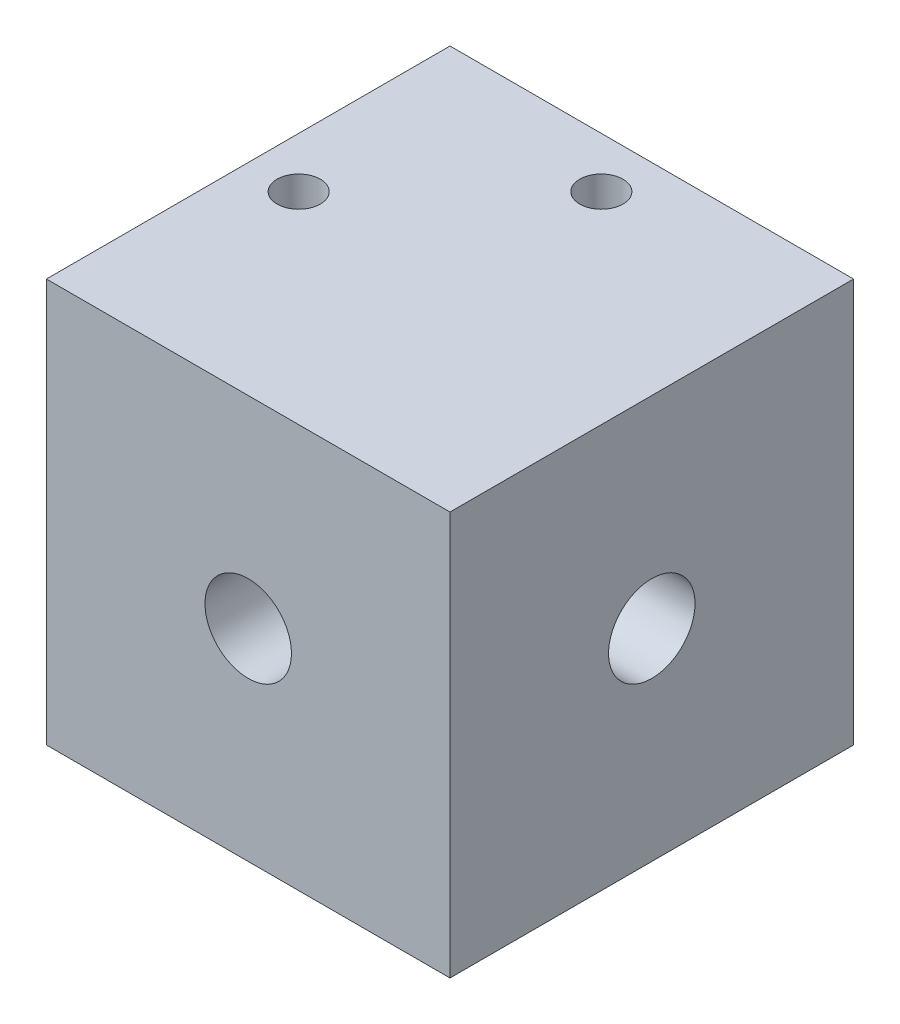
ISO-10303-21;
HEADER;
FILE_DESCRIPTION(('STEP AP214'),'2;1');
FILE_NAME('part.step','',(''),(''),'','','');
FILE_SCHEMA(('AUTOMOTIVE_DESIGN { 1 0 10303 214 1 1 1 1 }'));
ENDSEC;
DATA;
#1=APPLICATION_CONTEXT('core data for automotive mechanical design processes');
#2=APPLICATION_PROTOCOL_DEFINITION('international standard','automotive_design',2000,#1);
#3=PRODUCT_CONTEXT('',#1,'mechanical');
#4=PRODUCT('Part','Part','',(#3));
#5=PRODUCT_RELATED_PRODUCT_CATEGORY('part','',(#4));
#6=PRODUCT_DEFINITION_FORMATION('','',#4);
#7=PRODUCT_DEFINITION_CONTEXT('part definition',#1,'design');
#8=PRODUCT_DEFINITION('design','',#6,#7);
#9=PRODUCT_DEFINITION_SHAPE('','',#8);
#10=(LENGTH_UNIT() NAMED_UNIT(*) SI_UNIT(.MILLI.,.METRE.));
#11=(NAMED_UNIT(*) PLANE_ANGLE_UNIT() SI_UNIT($,.RADIAN.));
#12=(NAMED_UNIT(*) SI_UNIT($,.STERADIAN.) SOLID_ANGLE_UNIT());
#13=UNCERTAINTY_MEASURE_WITH_UNIT(LENGTH_MEASURE(1.E-05),#10,'distance_accuracy_value','');
#14=(GEOMETRIC_REPRESENTATION_CONTEXT(3) GLOBAL_UNCERTAINTY_ASSIGNED_CONTEXT((#13)) GLOBAL_UNIT_ASSIGNED_CONTEXT((#10,
#11,#12)) REPRESENTATION_CONTEXT('',''));
#15=CARTESIAN_POINT('',(0.,0.,0.));
#16=DIRECTION('',(0.,0.,1.));
#17=DIRECTION('',(1.,0.,0.));
#18=AXIS2_PLACEMENT_3D('',#15,#16,#17);
#19=CARTESIAN_POINT('',(0.,0.,28.));
#20=DIRECTION('',(1.,0.,0.));
#21=DIRECTION('',(0.,0.,-1.));
#22=AXIS2_PLACEMENT_3D('',#19,#20,#21);
#23=PLANE('',#22);
#24=CARTESIAN_POINT('',(0.,14.,14.));
#25=DIRECTION('',(-1.,0.,0.));
#26=DIRECTION('',(0.,0.,1.));
#27=AXIS2_PLACEMENT_3D('',#24,#25,#26);
#28=CIRCLE('',#27,3.175);
#29=CARTESIAN_POINT('',(0.,14.,17.175));
#30=VERTEX_POINT('',#29);
#31=EDGE_CURVE('E158',#30,#30,#28,.T.);
#32=ORIENTED_EDGE('',*,*,#31,.F.);
#33=EDGE_LOOP('',(#32));
#34=FACE_BOUND('',#33,.T.);
#35=DIRECTION('',(0.,-1.,0.));
#36=VECTOR('',#35,1.);
#37=CARTESIAN_POINT('',(0.,0.,0.));
#38=LINE('',#37,#36);
#39=CARTESIAN_POINT('',(0.,28.,0.));
#40=VERTEX_POINT('',#39);
#41=CARTESIAN_POINT('',(0.,0.,0.));
#42=VERTEX_POINT('',#41);
#43=EDGE_CURVE('E104',#40,#42,#38,.T.);
#44=ORIENTED_EDGE('',*,*,#43,.T.);
#45=DIRECTION('',(0.,0.,-1.));
#46=VECTOR('',#45,1.);
#47=CARTESIAN_POINT('',(0.,0.,28.));
#48=LINE('',#47,#46);
#49=CARTESIAN_POINT('',(0.,0.,28.));
#50=VERTEX_POINT('',#49);
#51=EDGE_CURVE('E11',#50,#42,#48,.T.);
#52=ORIENTED_EDGE('',*,*,#51,.F.);
#53=DIRECTION('',(0.,-1.,0.));
#54=VECTOR('',#53,1.);
#55=CARTESIAN_POINT('',(0.,0.,28.));
#56=LINE('',#55,#54);
#57=CARTESIAN_POINT('',(0.,28.,28.));
#58=VERTEX_POINT('',#57);
#59=EDGE_CURVE('E91',#58,#50,#56,.T.);
#60=ORIENTED_EDGE('',*,*,#59,.F.);
#61=DIRECTION('',(0.,0.,-1.));
#62=VECTOR('',#61,1.);
#63=CARTESIAN_POINT('',(0.,28.,28.));
#64=LINE('',#63,#62);
#65=EDGE_CURVE('E100',#58,#40,#64,.T.);
#66=ORIENTED_EDGE('',*,*,#65,.T.);
#67=EDGE_LOOP('',(#44,#52,#60,#66));
#68=FACE_BOUND('',#67,.T.);
#69=ADVANCED_FACE('F33',(#34,#68),#23,.F.);
#70=CARTESIAN_POINT('',(0.,0.,28.));
#71=DIRECTION('',(0.,1.,0.));
#72=DIRECTION('',(0.,0.,1.));
#73=AXIS2_PLACEMENT_3D('',#70,#71,#72);
#74=PLANE('',#73);
#75=DIRECTION('',(1.,0.,0.));
#76=VECTOR('',#75,1.);
#77=CARTESIAN_POINT('',(0.,0.,0.));
#78=LINE('',#77,#76);
#79=CARTESIAN_POINT('',(28.,0.,0.));
#80=VERTEX_POINT('',#79);
#81=EDGE_CURVE('E95',#42,#80,#78,.T.);
#82=ORIENTED_EDGE('',*,*,#81,.T.);
#83=DIRECTION('',(0.,0.,-1.));
#84=VECTOR('',#83,1.);
#85=CARTESIAN_POINT('',(28.,0.,28.));
#86=LINE('',#85,#84);
#87=CARTESIAN_POINT('',(28.,0.,28.));
#88=VERTEX_POINT('',#87);
#89=EDGE_CURVE('E47',#88,#80,#86,.T.);
#90=ORIENTED_EDGE('',*,*,#89,.F.);
#91=DIRECTION('',(1.,0.,0.));
#92=VECTOR('',#91,1.);
#93=CARTESIAN_POINT('',(0.,0.,28.));
#94=LINE('',#93,#92);
#95=EDGE_CURVE('E86',#50,#88,#94,.T.);
#96=ORIENTED_EDGE('',*,*,#95,.F.);
#97=ORIENTED_EDGE('',*,*,#51,.T.);
#98=EDGE_LOOP('',(#82,#90,#96,#97));
#99=FACE_BOUND('',#98,.T.);
#100=ADVANCED_FACE('F94',(#99),#74,.F.);
#101=CARTESIAN_POINT('',(28.,0.,28.));
#102=DIRECTION('',(-1.,0.,0.));
#103=DIRECTION('',(0.,0.,1.));
#104=AXIS2_PLACEMENT_3D('',#101,#102,#103);
#105=PLANE('',#104);
#106=CARTESIAN_POINT('',(28.,14.,14.));
#107=DIRECTION('',(1.,0.,0.));
#108=DIRECTION('',(0.,0.,-1.));
#109=AXIS2_PLACEMENT_3D('',#106,#107,#108);
#110=CIRCLE('',#109,3.);
#111=CARTESIAN_POINT('',(28.,14.,11.));
#112=VERTEX_POINT('',#111);
#113=EDGE_CURVE('E188',#112,#112,#110,.T.);
#114=ORIENTED_EDGE('',*,*,#113,.F.);
#115=EDGE_LOOP('',(#114));
#116=FACE_BOUND('',#115,.T.);
#117=DIRECTION('',(0.,1.,0.));
#118=VECTOR('',#117,1.);
#119=CARTESIAN_POINT('',(28.,0.,0.));
#120=LINE('',#119,#118);
#121=CARTESIAN_POINT('',(28.,28.,0.));
#122=VERTEX_POINT('',#121);
#123=EDGE_CURVE('E73',#80,#122,#120,.T.);
#124=ORIENTED_EDGE('',*,*,#123,.T.);
#125=DIRECTION('',(0.,0.,-1.));
#126=VECTOR('',#125,1.);
#127=CARTESIAN_POINT('',(28.,28.,28.));
#128=LINE('',#127,#126);
#129=CARTESIAN_POINT('',(28.,28.,28.));
#130=VERTEX_POINT('',#129);
#131=EDGE_CURVE('E96',#130,#122,#128,.T.);
#132=ORIENTED_EDGE('',*,*,#131,.F.);
#133=DIRECTION('',(0.,1.,0.));
#134=VECTOR('',#133,1.);
#135=CARTESIAN_POINT('',(28.,0.,28.));
#136=LINE('',#135,#134);
#137=EDGE_CURVE('E89',#88,#130,#136,.T.);
#138=ORIENTED_EDGE('',*,*,#137,.F.);
#139=ORIENTED_EDGE('',*,*,#89,.T.);
#140=EDGE_LOOP('',(#124,#132,#138,#139));
#141=FACE_BOUND('',#140,.T.);
#142=ADVANCED_FACE('F98',(#116,#141),#105,.F.);
#143=CARTESIAN_POINT('',(0.,28.,28.));
#144=DIRECTION('',(0.,-1.,0.));
#145=DIRECTION('',(0.,0.,-1.));
#146=AXIS2_PLACEMENT_3D('',#143,#144,#145);
#147=PLANE('',#146);
#148=CARTESIAN_POINT('',(14.,28.,3.5));
#149=DIRECTION('',(0.,1.,0.));
#150=DIRECTION('',(0.,0.,1.));
#151=AXIS2_PLACEMENT_3D('',#148,#149,#150);
#152=CIRCLE('',#151,1.5);
#153=CARTESIAN_POINT('',(14.,28.,5.));
#154=VERTEX_POINT('',#153);
#155=EDGE_CURVE('E119',#154,#154,#152,.T.);
#156=ORIENTED_EDGE('',*,*,#155,.F.);
#157=EDGE_LOOP('',(#156));
#158=FACE_BOUND('',#157,.T.);
#159=CARTESIAN_POINT('',(3.5,28.,14.));
#160=DIRECTION('',(0.,1.,0.));
#161=DIRECTION('',(0.,0.,1.));
#162=AXIS2_PLACEMENT_3D('',#159,#160,#161);
#163=CIRCLE('',#162,1.5);
#164=CARTESIAN_POINT('',(3.5,28.,15.5));
#165=VERTEX_POINT('',#164);
#166=EDGE_CURVE('E308',#165,#165,#163,.T.);
#167=ORIENTED_EDGE('',*,*,#166,.F.);
#168=EDGE_LOOP('',(#167));
#169=FACE_BOUND('',#168,.T.);
#170=DIRECTION('',(-1.,0.,0.));
#171=VECTOR('',#170,1.);
#172=CARTESIAN_POINT('',(0.,28.,0.));
#173=LINE('',#172,#171);
#174=EDGE_CURVE('E79',#122,#40,#173,.T.);
#175=ORIENTED_EDGE('',*,*,#174,.T.);
#176=ORIENTED_EDGE('',*,*,#65,.F.);
#177=DIRECTION('',(-1.,0.,0.));
#178=VECTOR('',#177,1.);
#179=CARTESIAN_POINT('',(0.,28.,28.));
#180=LINE('',#179,#178);
#181=EDGE_CURVE('E56',#130,#58,#180,.T.);
#182=ORIENTED_EDGE('',*,*,#181,.F.);
#183=ORIENTED_EDGE('',*,*,#131,.T.);
#184=EDGE_LOOP('',(#175,#176,#182,#183));
#185=FACE_BOUND('',#184,.T.);
#186=ADVANCED_FACE('F173',(#158,#169,#185),#147,.F.);
#187=CARTESIAN_POINT('',(0.,0.,28.));
#188=DIRECTION('',(0.,0.,-1.));
#189=DIRECTION('',(-1.,0.,0.));
#190=AXIS2_PLACEMENT_3D('',#187,#188,#189);
#191=PLANE('',#190);
#192=CARTESIAN_POINT('',(14.,14.,28.));
#193=DIRECTION('',(0.,0.,1.));
#194=DIRECTION('',(1.,0.,0.));
#195=AXIS2_PLACEMENT_3D('',#192,#193,#194);
#196=CIRCLE('',#195,3.);
#197=CARTESIAN_POINT('',(17.,14.,28.));
#198=VERTEX_POINT('',#197);
#199=EDGE_CURVE('E303',#198,#198,#196,.T.);
#200=ORIENTED_EDGE('',*,*,#199,.F.);
#201=EDGE_LOOP('',(#200));
#202=FACE_BOUND('',#201,.T.);
#203=ORIENTED_EDGE('',*,*,#59,.T.);
#204=ORIENTED_EDGE('',*,*,#95,.T.);
#205=ORIENTED_EDGE('',*,*,#137,.T.);
#206=ORIENTED_EDGE('',*,*,#181,.T.);
#207=EDGE_LOOP('',(#203,#204,#205,#206));
#208=FACE_BOUND('',#207,.T.);
#209=ADVANCED_FACE('F87',(#202,#208),#191,.F.);
#210=CARTESIAN_POINT('',(0.,0.,0.));
#211=DIRECTION('',(0.,0.,-1.));
#212=DIRECTION('',(-1.,0.,0.));
#213=AXIS2_PLACEMENT_3D('',#210,#211,#212);
#214=PLANE('',#213);
#215=CARTESIAN_POINT('',(14.,14.,0.));
#216=DIRECTION('',(0.,0.,-1.));
#217=DIRECTION('',(-1.,0.,0.));
#218=AXIS2_PLACEMENT_3D('',#215,#216,#217);
#219=CIRCLE('',#218,3.175);
#220=CARTESIAN_POINT('',(10.825,14.,0.));
#221=VERTEX_POINT('',#220);
#222=EDGE_CURVE('E195',#221,#221,#219,.T.);
#223=ORIENTED_EDGE('',*,*,#222,.F.);
#224=EDGE_LOOP('',(#223));
#225=FACE_BOUND('',#224,.T.);
#226=ORIENTED_EDGE('',*,*,#43,.F.);
#227=ORIENTED_EDGE('',*,*,#174,.F.);
#228=ORIENTED_EDGE('',*,*,#123,.F.);
#229=ORIENTED_EDGE('',*,*,#81,.F.);
#230=EDGE_LOOP('',(#226,#227,#228,#229));
#231=FACE_BOUND('',#230,.T.);
#232=ADVANCED_FACE('F161',(#225,#231),#214,.T.);
#233=CARTESIAN_POINT('',(10.,14.,14.));
#234=DIRECTION('',(-1.,0.,0.));
#235=DIRECTION('',(0.,0.,1.));
#236=AXIS2_PLACEMENT_3D('',#233,#234,#235);
#237=CYLINDRICAL_SURFACE('',#236,3.175);
#238=CARTESIAN_POINT('',(3.5,16.7983253920872,15.5));
#239=CARTESIAN_POINT('',(3.57881074760103,16.7983309764998,15.4999952354705));
#240=CARTESIAN_POINT('',(3.65773561220573,16.8017042715932,15.4937483244933));
#241=CARTESIAN_POINT('',(3.81321466751469,16.8147264456166,15.4690554061353));
#242=CARTESIAN_POINT('',(3.8897629071629,16.8243899258535,15.4505810136149));
#243=CARTESIAN_POINT('',(4.03795267375673,16.8486300939643,15.4023725335564));
#244=CARTESIAN_POINT('',(4.10961613643182,16.8631827990612,15.3726933219799));
#245=CARTESIAN_POINT('',(4.24692939284759,16.8955250237702,15.3030839906454));
#246=CARTESIAN_POINT('',(4.3125794422789,16.9133144056627,15.2631543070128));
#247=CARTESIAN_POINT('',(4.4413232452584,16.9517222772286,15.1707430871524));
#248=CARTESIAN_POINT('',(4.50387788849068,16.9724525418849,15.117556586508));
#249=CARTESIAN_POINT('',(4.61959143684936,17.0134995104479,15.0016125967222));
#250=CARTESIAN_POINT('',(4.67274606260041,17.0338160222877,14.9388507724919));
#251=CARTESIAN_POINT('',(4.77118937954777,17.0731728871697,14.8010349007045));
#252=CARTESIAN_POINT('',(4.81583450125175,17.0920686666025,14.7254760172334));
#253=CARTESIAN_POINT('',(4.89153752206177,17.1250338159502,14.5668616866192));
#254=CARTESIAN_POINT('',(4.92260309774527,17.1391059117413,14.4838105070236));
#255=CARTESIAN_POINT('',(4.96819431985617,17.1600375054618,14.3182638331671));
#256=CARTESIAN_POINT('',(4.9836598006004,17.1673046412502,14.2360798375968));
#257=CARTESIAN_POINT('',(5.00068669846295,17.1753150092679,14.0699854874354));
#258=CARTESIAN_POINT('',(5.00225551712035,17.1760617143584,13.9860760756969));
#259=CARTESIAN_POINT('',(4.99185310738047,17.1711569999128,13.8258959530441));
#260=CARTESIAN_POINT('',(4.9809263684281,17.1659991039016,13.7495390736925));
#261=CARTESIAN_POINT('',(4.94768451199486,17.1505871330944,13.5998932424077));
#262=CARTESIAN_POINT('',(4.92536854800002,17.1403326794939,13.5266045189561));
#263=CARTESIAN_POINT('',(4.86978180811971,17.1154938397116,13.3838378400075));
#264=CARTESIAN_POINT('',(4.83635400002596,17.1008476991608,13.3144322145481));
#265=CARTESIAN_POINT('',(4.75968096352203,17.068584813897,13.1820377817159));
#266=CARTESIAN_POINT('',(4.71643213988174,17.0509669819304,13.11905133651));
#267=CARTESIAN_POINT('',(4.61701776567009,17.0126518994224,12.9954633310695));
#268=CARTESIAN_POINT('',(4.56005736803148,16.9918200943109,12.9355421585215));
#269=CARTESIAN_POINT('',(4.43699705964444,16.9504628336178,12.8257587506611));
#270=CARTESIAN_POINT('',(4.37089145595116,16.929937577752,12.7759028289429));
#271=CARTESIAN_POINT('',(4.22717213815108,16.8903971106644,12.6851582576916));
#272=CARTESIAN_POINT('',(4.1491389419963,16.8715157726024,12.6448701363454));
#273=CARTESIAN_POINT('',(3.98628374353103,16.8391483414,12.5782943705373));
#274=CARTESIAN_POINT('',(3.90146821987563,16.8256571716003,12.5519935445559));
#275=CARTESIAN_POINT('',(3.7342537047376,16.8069797461398,12.516129400851));
#276=CARTESIAN_POINT('',(3.65215755806985,16.8012422746467,12.5054500864004));
#277=CARTESIAN_POINT('',(3.48716354553712,16.7971423453247,12.4977867197404));
#278=CARTESIAN_POINT('',(3.40426614677313,16.7987758220601,12.500795118101));
#279=CARTESIAN_POINT('',(3.24815889881929,16.8086528438024,12.5193982652436));
#280=CARTESIAN_POINT('',(3.17476186646032,16.8162714412626,12.5338039110307));
#281=CARTESIAN_POINT('',(3.03153636694861,16.8363794851209,12.5730943784603));
#282=CARTESIAN_POINT('',(2.96170892426149,16.8488703210638,12.5979821897404));
#283=CARTESIAN_POINT('',(2.82396419247503,16.8780031481495,12.6587675405726));
#284=CARTESIAN_POINT('',(2.75628400585994,16.8948101939309,12.6951204110158));
#285=CARTESIAN_POINT('',(2.62761017139926,16.9305050785042,12.7773903258312));
#286=CARTESIAN_POINT('',(2.56661988219401,16.9493939530175,12.8233121410168));
#287=CARTESIAN_POINT('',(2.44604877570716,16.9896253343588,12.9293374977957));
#288=CARTESIAN_POINT('',(2.38736099080934,17.0110091844446,12.9904453775233));
#289=CARTESIAN_POINT('',(2.2808337868781,17.0519781646558,13.1220471641673));
#290=CARTESIAN_POINT('',(2.23299686115371,17.0715628807626,13.192543222404));
#291=CARTESIAN_POINT('',(2.14893659567304,17.1071725849173,13.3426259507084));
#292=CARTESIAN_POINT('',(2.11291755822127,17.1231336156543,13.4223432461177));
#293=CARTESIAN_POINT('',(2.05513406497645,17.1492209359764,13.5876727067004));
#294=CARTESIAN_POINT('',(2.03335845768791,17.1593517893872,13.6732802021271));
#295=CARTESIAN_POINT('',(2.00636110564541,17.1719797104458,13.8401036671258));
#296=CARTESIAN_POINT('',(1.99988986367358,17.1750523384011,13.9210746017159));
#297=CARTESIAN_POINT('',(2.00011288034317,17.1749463652988,14.0829833461657));
#298=CARTESIAN_POINT('',(2.00680346488907,17.1717695087712,14.163921158963));
#299=CARTESIAN_POINT('',(2.03229151976912,17.1598541037809,14.3188418428355));
#300=CARTESIAN_POINT('',(2.05040802508006,17.1514286867549,14.3929631676006));
#301=CARTESIAN_POINT('',(2.09737891452522,17.1301013292898,14.5370264340225));
#302=CARTESIAN_POINT('',(2.12623500759118,17.1171986764347,14.606967708474));
#303=CARTESIAN_POINT('',(2.19526509810714,17.0873851030128,14.7441984436184));
#304=CARTESIAN_POINT('',(2.23589060609179,17.0703197298679,14.8112262861311));
#305=CARTESIAN_POINT('',(2.32671567908028,17.0340547772448,14.9378054129076));
#306=CARTESIAN_POINT('',(2.37691959144519,17.01485423033,14.9973532817963));
#307=CARTESIAN_POINT('',(2.49071553221918,16.9742574938223,15.1128761340612));
#308=CARTESIAN_POINT('',(2.5551036268264,16.9528185885393,15.1680544294268));
#309=CARTESIAN_POINT('',(2.69268785425151,16.9117133370068,15.2670565138128));
#310=CARTESIAN_POINT('',(2.76589040125549,16.8920483000069,15.3108719601901));
#311=CARTESIAN_POINT('',(2.9207675777892,16.8566355494113,15.3863737982034));
#312=CARTESIAN_POINT('',(3.00256064747477,16.84095675907,15.417851302723));
#313=CARTESIAN_POINT('',(3.17118800167078,16.8163562821414,15.4661232120466));
#314=CARTESIAN_POINT('',(3.25800430332792,16.8074119248326,15.4829669096812));
#315=CARTESIAN_POINT('',(3.37130536675201,16.8011642967236,15.4946926867287));
#316=CARTESIAN_POINT('',(3.39698819225242,16.8001026010393,15.4966804894051));
#317=CARTESIAN_POINT('',(3.44844327049182,16.7986822173246,15.4993349590309));
#318=CARTESIAN_POINT('',(3.47421552771091,16.7983235650378,15.5000015588087));
#319=CARTESIAN_POINT('',(3.5,16.7983253920872,15.5));
#320=B_SPLINE_CURVE_WITH_KNOTS('',3,(#238,#239,#240,#241,#242,#243,#244,#245,#246,#247,#248,
#249,#250,#251,#252,#253,#254,#255,#256,#257,#258,#259,#260,#261,#262,#263,#264,#265,#266,#267,
#268,#269,#270,#271,#272,#273,#274,#275,#276,#277,#278,#279,#280,#281,#282,#283,#284,#285,#286,
#287,#288,#289,#290,#291,#292,#293,#294,#295,#296,#297,#298,#299,#300,#301,#302,#303,#304,#305,
#306,#307,#308,#309,#310,#311,#312,#313,#314,#315,#316,#317,#318,#319),.UNSPECIFIED.,.T.,.F.,(4,
2,2,2,2,2,2,2,2,2,2,2,2,2,2,2,2,2,2,2,2,2,2,2,2,2,2,2,2,2,2,2,2,2,2,2,2,2,2,2,4),(0.,
0.236323871838544,0.473198284289302,0.708927337380699,0.944646362603914,1.19762429635865,
1.45071710395354,1.71864285343498,1.98641694681215,2.23687152724756,2.48719270436037,
2.7180281701866,2.94888079555674,3.1831453100556,3.41749572162706,3.67216706074964,
3.92699765369087,4.19506898546716,4.46288723920479,4.71043828617547,4.95785281342715,
5.18239796950746,5.40700721193729,5.64198832122139,5.87708686716682,6.13804637958085,
6.39906579463174,6.66438519401193,6.92949661955738,7.17207877892644,7.41459323161728,
7.64386670961211,7.87317668624822,8.11282240294707,8.35257714778319,8.61378861881715,
8.87519133270404,9.14084608292566,9.40560248746476,9.48291651801969,9.56023447921351),.UNSPECIFIED.);
#321=CARTESIAN_POINT('',(3.5,16.7983253920872,15.5));
#322=VERTEX_POINT('',#321);
#323=EDGE_CURVE('E36',#322,#322,#320,.T.);
#324=ORIENTED_EDGE('',*,*,#323,.T.);
#325=EDGE_LOOP('',(#324));
#326=FACE_BOUND('',#325,.T.);
#327=CARTESIAN_POINT('',(10.,14.,14.));
#328=DIRECTION('',(-1.,0.,0.));
#329=DIRECTION('',(0.,0.,1.));
#330=AXIS2_PLACEMENT_3D('',#327,#328,#329);
#331=CIRCLE('',#330,3.175);
#332=CARTESIAN_POINT('',(10.,14.,17.175));
#333=VERTEX_POINT('',#332);
#334=EDGE_CURVE('E107',#333,#333,#331,.T.);
#335=ORIENTED_EDGE('',*,*,#334,.F.);
#336=EDGE_LOOP('',(#335));
#337=FACE_BOUND('',#336,.T.);
#338=ORIENTED_EDGE('',*,*,#31,.T.);
#339=EDGE_LOOP('',(#338));
#340=FACE_BOUND('',#339,.T.);
#341=ADVANCED_FACE('F163',(#326,#337,#340),#237,.F.);
#342=CARTESIAN_POINT('',(10.,14.,14.));
#343=DIRECTION('',(-1.,0.,0.));
#344=DIRECTION('',(0.,0.,1.));
#345=AXIS2_PLACEMENT_3D('',#342,#343,#344);
#346=PLANE('',#345);
#347=ORIENTED_EDGE('',*,*,#334,.T.);
#348=EDGE_LOOP('',(#347));
#349=FACE_BOUND('',#348,.T.);
#350=ADVANCED_FACE('F171',(#349),#346,.T.);
#351=CARTESIAN_POINT('',(18.,14.,14.));
#352=DIRECTION('',(1.,0.,0.));
#353=DIRECTION('',(0.,0.,-1.));
#354=AXIS2_PLACEMENT_3D('',#351,#352,#353);
#355=CYLINDRICAL_SURFACE('',#354,3.);
#356=CARTESIAN_POINT('',(18.,14.,14.));
#357=DIRECTION('',(1.,0.,0.));
#358=DIRECTION('',(0.,0.,-1.));
#359=AXIS2_PLACEMENT_3D('',#356,#357,#358);
#360=CIRCLE('',#359,3.);
#361=CARTESIAN_POINT('',(18.,14.,11.));
#362=VERTEX_POINT('',#361);
#363=EDGE_CURVE('E190',#362,#362,#360,.T.);
#364=ORIENTED_EDGE('',*,*,#363,.F.);
#365=EDGE_LOOP('',(#364));
#366=FACE_BOUND('',#365,.T.);
#367=ORIENTED_EDGE('',*,*,#113,.T.);
#368=EDGE_LOOP('',(#367));
#369=FACE_BOUND('',#368,.T.);
#370=ADVANCED_FACE('F206',(#366,#369),#355,.F.);
#371=CARTESIAN_POINT('',(18.,14.,14.));
#372=DIRECTION('',(1.,0.,0.));
#373=DIRECTION('',(0.,0.,-1.));
#374=AXIS2_PLACEMENT_3D('',#371,#372,#373);
#375=PLANE('',#374);
#376=ORIENTED_EDGE('',*,*,#363,.T.);
#377=EDGE_LOOP('',(#376));
#378=FACE_BOUND('',#377,.T.);
#379=ADVANCED_FACE('F147',(#378),#375,.T.);
#380=CARTESIAN_POINT('',(14.,14.,10.));
#381=DIRECTION('',(0.,0.,-1.));
#382=DIRECTION('',(-1.,0.,0.));
#383=AXIS2_PLACEMENT_3D('',#380,#381,#382);
#384=CYLINDRICAL_SURFACE('',#383,3.175);
#385=CARTESIAN_POINT('',(14.,17.175,5.));
#386=CARTESIAN_POINT('',(14.0793696056332,17.1749962198529,4.99999552610351));
#387=CARTESIAN_POINT('',(14.1588489662133,17.1719912037081,4.99366335348418));
#388=CARTESIAN_POINT('',(14.3154907966577,17.1602676274242,4.9685996128575));
#389=CARTESIAN_POINT('',(14.3926478760417,17.1515367075325,4.94984122112576));
#390=CARTESIAN_POINT('',(14.5421346140165,17.1292818514019,4.90080463386028));
#391=CARTESIAN_POINT('',(14.614481134827,17.1157758339669,4.87056947468804));
#392=CARTESIAN_POINT('',(14.7529827574799,17.0852355755794,4.79964446831745));
#393=CARTESIAN_POINT('',(14.819138798737,17.0682018712234,4.75895621091421));
#394=CARTESIAN_POINT('',(14.9475319775514,17.0310921500245,4.66568662754686));
#395=CARTESIAN_POINT('',(15.009345315363,17.0108994960739,4.61256891765261));
#396=CARTESIAN_POINT('',(15.1235687280467,16.9701687775105,4.49709401541805));
#397=CARTESIAN_POINT('',(15.1759724512306,16.9496304897401,4.43473063351146));
#398=CARTESIAN_POINT('',(15.2734072110871,16.9089573421116,4.2974843645497));
#399=CARTESIAN_POINT('',(15.317705296114,16.8889425290662,4.22204154314482));
#400=CARTESIAN_POINT('',(15.3927986049707,16.8535019491363,4.06371450605077));
#401=CARTESIAN_POINT('',(15.4236026358555,16.8380731912287,3.98083518657092));
#402=CARTESIAN_POINT('',(15.4689676208797,16.8148498152315,3.81481732997647));
#403=CARTESIAN_POINT('',(15.4843494240768,16.806672451712,3.73195910458647));
#404=CARTESIAN_POINT('',(15.5009699497078,16.7978229064724,3.56446669966953));
#405=CARTESIAN_POINT('',(15.5022201551264,16.7971446311897,3.47983401805993));
#406=CARTESIAN_POINT('',(15.4911487105296,16.8030559326381,3.32062469140227));
#407=CARTESIAN_POINT('',(15.4802236603169,16.808897712241,3.24591684055565));
#408=CARTESIAN_POINT('',(15.447504692431,16.8258965791071,3.09955531913525));
#409=CARTESIAN_POINT('',(15.4257078792116,16.8370550823719,3.02790246774061));
#410=CARTESIAN_POINT('',(15.3714404210704,16.8636871107933,2.88767854274785));
#411=CARTESIAN_POINT('',(15.3387342163375,16.8792546044257,2.8192173067294));
#412=CARTESIAN_POINT('',(15.2637503491799,16.9129448124016,2.68844422930819));
#413=CARTESIAN_POINT('',(15.2214684733696,16.9310686502324,2.62613511227864));
#414=CARTESIAN_POINT('',(15.1230182930409,16.9702796730848,2.50211398210142));
#415=CARTESIAN_POINT('',(15.0658268591397,16.9914718417441,2.44124465826451));
#416=CARTESIAN_POINT('',(14.9419116545217,17.0327696924474,2.32963307898786));
#417=CARTESIAN_POINT('',(14.8751842405231,17.0528749551668,2.27889471198726));
#418=CARTESIAN_POINT('',(14.7309004519425,17.0906581318842,2.18723446950541));
#419=CARTESIAN_POINT('',(14.6530327647494,17.1082173793419,2.1467498749094));
#420=CARTESIAN_POINT('',(14.49054980641,17.1379589656138,2.07976514725872));
#421=CARTESIAN_POINT('',(14.4059393893946,17.1501451319824,2.05325505672055));
#422=CARTESIAN_POINT('',(14.2393253311837,17.1669884938552,2.01695327830055));
#423=CARTESIAN_POINT('',(14.1576180853724,17.1721506963645,2.00603697774867));
#424=CARTESIAN_POINT('',(13.9933799376267,17.176053743089,1.99776549827472));
#425=CARTESIAN_POINT('',(13.9108493799086,17.1747971671513,2.00040487103399));
#426=CARTESIAN_POINT('',(13.7532090952437,17.166312504254,2.01845895022593));
#427=CARTESIAN_POINT('',(13.6779743827367,17.159493038986,2.03299968212115));
#428=CARTESIAN_POINT('',(13.5311400886124,17.1410624985619,2.07312746629385));
#429=CARTESIAN_POINT('',(13.4595409292445,17.1294508682454,2.09871579842439));
#430=CARTESIAN_POINT('',(13.3195173353867,17.1020662900049,2.16097277598054));
#431=CARTESIAN_POINT('',(13.2512555663097,17.0861775760538,2.19795459585581));
#432=CARTESIAN_POINT('',(13.1216665868865,17.0518284264566,2.28160542554883));
#433=CARTESIAN_POINT('',(13.0603424375466,17.0333668635778,2.32827868585652));
#434=CARTESIAN_POINT('',(12.9405552849953,16.9937484761592,2.43484016430619));
#435=CARTESIAN_POINT('',(12.8828417829848,16.972498405013,2.49553803008255));
#436=CARTESIAN_POINT('',(12.7781241783603,16.9310107026401,2.6259200433733));
#437=CARTESIAN_POINT('',(12.7311255615651,16.9107735941505,2.69560876557418));
#438=CARTESIAN_POINT('',(12.6476822639998,16.8729842223829,2.84515860569975));
#439=CARTESIAN_POINT('',(12.6116642516864,16.8555506324579,2.9252902768506));
#440=CARTESIAN_POINT('',(12.5540020334893,16.8267950409338,3.09157573608092));
#441=CARTESIAN_POINT('',(12.5323414502105,16.8154660786089,3.17772253828127));
#442=CARTESIAN_POINT('',(12.5058344464147,16.8014814830717,3.34513659709301));
#443=CARTESIAN_POINT('',(12.4996325114881,16.7981279282329,3.42613047173134));
#444=CARTESIAN_POINT('',(12.5004008875279,16.7985407587054,3.58802567182791));
#445=CARTESIAN_POINT('',(12.5073672166887,16.8023049917478,3.66892701786345));
#446=CARTESIAN_POINT('',(12.5330445254315,16.8158210937383,3.82186185816675));
#447=CARTESIAN_POINT('',(12.5508163710003,16.8250929307701,3.894100315709));
#448=CARTESIAN_POINT('',(12.5965273788888,16.848076581696,4.03452895410737));
#449=CARTESIAN_POINT('',(12.6244696000373,16.8617897312164,4.1027179098565));
#450=CARTESIAN_POINT('',(12.6918383409616,16.8932343336355,4.23811055182919));
#451=CARTESIAN_POINT('',(12.7319059246599,16.9111726221189,4.3049459695603));
#452=CARTESIAN_POINT('',(12.8216193026593,16.9486278169195,4.43136079818433));
#453=CARTESIAN_POINT('',(12.8712696765585,16.9681454754144,4.49093671747963));
#454=CARTESIAN_POINT('',(12.984810546229,17.0089894883919,4.6075560784686));
#455=CARTESIAN_POINT('',(13.0496444590915,17.0302931523651,4.66369381341707));
#456=CARTESIAN_POINT('',(13.1884935537988,17.0703906077135,4.76444175427494));
#457=CARTESIAN_POINT('',(13.2625131498698,17.0891831832939,4.80904638589811));
#458=CARTESIAN_POINT('',(13.4176896766403,17.1221480350956,4.8850463197749));
#459=CARTESIAN_POINT('',(13.4988207047534,17.1363362610532,4.91648733383919));
#460=CARTESIAN_POINT('',(13.6659587975105,17.1584955078923,4.96490242402554));
#461=CARTESIAN_POINT('',(13.7519506429211,17.1664848936211,4.98191924759624));
#462=CARTESIAN_POINT('',(13.8655506725104,17.1722666617444,4.99420643339842));
#463=CARTESIAN_POINT('',(13.8923802491838,17.1732895170822,4.99637655199677));
#464=CARTESIAN_POINT('',(13.946135668054,17.174656835165,4.99927411038089));
#465=CARTESIAN_POINT('',(13.9730615123532,17.175001283003,5.00000151846547));
#466=CARTESIAN_POINT('',(14.,17.175,5.));
#467=B_SPLINE_CURVE_WITH_KNOTS('',3,(#385,#386,#387,#388,#389,#390,#391,#392,#393,#394,#395,
#396,#397,#398,#399,#400,#401,#402,#403,#404,#405,#406,#407,#408,#409,#410,#411,#412,#413,#414,
#415,#416,#417,#418,#419,#420,#421,#422,#423,#424,#425,#426,#427,#428,#429,#430,#431,#432,#433,
#434,#435,#436,#437,#438,#439,#440,#441,#442,#443,#444,#445,#446,#447,#448,#449,#450,#451,#452,
#453,#454,#455,#456,#457,#458,#459,#460,#461,#462,#463,#464,#465,#466),.UNSPECIFIED.,.T.,.F.,(4,
2,2,2,2,2,2,2,2,2,2,2,2,2,2,2,2,2,2,2,2,2,2,2,2,2,2,2,2,2,2,2,2,2,2,2,2,2,2,2,4),(0.,
0.237998863435126,0.476513162034361,0.714141760487186,0.951734239756924,1.202566267352,
1.45356698050229,1.72144991719773,1.98915775546694,2.24170968929962,2.4940563909499,
2.72018464462581,2.94637315667183,3.17780125644152,3.40933138528568,3.66670059385932,
3.92416839616743,4.19124985366182,4.45814074508091,4.70459764976703,4.9509555058397,
5.18069145066332,5.41045401730286,5.64720089890939,5.88405183355053,6.14213867221334,
6.40035735120202,6.66760822573517,6.93455372246491,7.17710763594645,7.41958821796886,
7.64352093670394,7.86752106087491,8.10644389425158,8.34548119240928,8.60934561245707,
8.8733373285024,9.13640455025374,9.39868939422997,9.47946576344204,9.56024390756227),.UNSPECIFIED.);
#468=CARTESIAN_POINT('',(14.,17.175,5.));
#469=VERTEX_POINT('',#468);
#470=EDGE_CURVE('E112',#469,#469,#467,.T.);
#471=ORIENTED_EDGE('',*,*,#470,.T.);
#472=EDGE_LOOP('',(#471));
#473=FACE_BOUND('',#472,.T.);
#474=CARTESIAN_POINT('',(14.,14.,10.));
#475=DIRECTION('',(0.,0.,-1.));
#476=DIRECTION('',(-1.,0.,0.));
#477=AXIS2_PLACEMENT_3D('',#474,#475,#476);
#478=CIRCLE('',#477,3.175);
#479=CARTESIAN_POINT('',(10.825,14.,10.));
#480=VERTEX_POINT('',#479);
#481=EDGE_CURVE('E191',#480,#480,#478,.T.);
#482=ORIENTED_EDGE('',*,*,#481,.F.);
#483=EDGE_LOOP('',(#482));
#484=FACE_BOUND('',#483,.T.);
#485=ORIENTED_EDGE('',*,*,#222,.T.);
#486=EDGE_LOOP('',(#485));
#487=FACE_BOUND('',#486,.T.);
#488=ADVANCED_FACE('F120',(#473,#484,#487),#384,.F.);
#489=CARTESIAN_POINT('',(14.,14.,10.));
#490=DIRECTION('',(0.,0.,-1.));
#491=DIRECTION('',(-1.,0.,0.));
#492=AXIS2_PLACEMENT_3D('',#489,#490,#491);
#493=PLANE('',#492);
#494=ORIENTED_EDGE('',*,*,#481,.T.);
#495=EDGE_LOOP('',(#494));
#496=FACE_BOUND('',#495,.T.);
#497=ADVANCED_FACE('F139',(#496),#493,.T.);
#498=CARTESIAN_POINT('',(14.,14.,18.));
#499=DIRECTION('',(0.,0.,1.));
#500=DIRECTION('',(1.,0.,0.));
#501=AXIS2_PLACEMENT_3D('',#498,#499,#500);
#502=CYLINDRICAL_SURFACE('',#501,3.);
#503=CARTESIAN_POINT('',(14.,14.,18.));
#504=DIRECTION('',(0.,0.,1.));
#505=DIRECTION('',(1.,0.,0.));
#506=AXIS2_PLACEMENT_3D('',#503,#504,#505);
#507=CIRCLE('',#506,3.);
#508=CARTESIAN_POINT('',(17.,14.,18.));
#509=VERTEX_POINT('',#508);
#510=EDGE_CURVE('E301',#509,#509,#507,.T.);
#511=ORIENTED_EDGE('',*,*,#510,.F.);
#512=EDGE_LOOP('',(#511));
#513=FACE_BOUND('',#512,.T.);
#514=ORIENTED_EDGE('',*,*,#199,.T.);
#515=EDGE_LOOP('',(#514));
#516=FACE_BOUND('',#515,.T.);
#517=ADVANCED_FACE('F136',(#513,#516),#502,.F.);
#518=CARTESIAN_POINT('',(14.,14.,18.));
#519=DIRECTION('',(0.,0.,1.));
#520=DIRECTION('',(1.,0.,0.));
#521=AXIS2_PLACEMENT_3D('',#518,#519,#520);
#522=PLANE('',#521);
#523=ORIENTED_EDGE('',*,*,#510,.T.);
#524=EDGE_LOOP('',(#523));
#525=FACE_BOUND('',#524,.T.);
#526=ADVANCED_FACE('F128',(#525),#522,.T.);
#527=CARTESIAN_POINT('',(14.,16.,3.5));
#528=DIRECTION('',(0.,1.,0.));
#529=DIRECTION('',(0.,0.,1.));
#530=AXIS2_PLACEMENT_3D('',#527,#528,#529);
#531=CYLINDRICAL_SURFACE('',#530,1.5);
#532=ORIENTED_EDGE('',*,*,#155,.T.);
#533=EDGE_LOOP('',(#532));
#534=FACE_BOUND('',#533,.T.);
#535=ORIENTED_EDGE('',*,*,#470,.F.);
#536=EDGE_LOOP('',(#535));
#537=FACE_BOUND('',#536,.T.);
#538=ADVANCED_FACE('F124',(#534,#537),#531,.F.);
#539=CARTESIAN_POINT('',(3.5,16.,14.));
#540=DIRECTION('',(0.,1.,0.));
#541=DIRECTION('',(0.,0.,1.));
#542=AXIS2_PLACEMENT_3D('',#539,#540,#541);
#543=CYLINDRICAL_SURFACE('',#542,1.5);
#544=ORIENTED_EDGE('',*,*,#166,.T.);
#545=EDGE_LOOP('',(#544));
#546=FACE_BOUND('',#545,.T.);
#547=ORIENTED_EDGE('',*,*,#323,.F.);
#548=EDGE_LOOP('',(#547));
#549=FACE_BOUND('',#548,.T.);
#550=ADVANCED_FACE('F127',(#546,#549),#543,.F.);
#551=CLOSED_SHELL('',(#69,#100,#142,#186,#209,#232,#341,#350,#370,#379,#488,#497,#517,#526,#538,#550));
#552=MANIFOLD_SOLID_BREP('B2',#551);
#553=ADVANCED_BREP_SHAPE_REPRESENTATION('',(#18,#552),#14);
#554=SHAPE_DEFINITION_REPRESENTATION(#9,#553);
ENDSEC;
END-ISO-10303-21;
